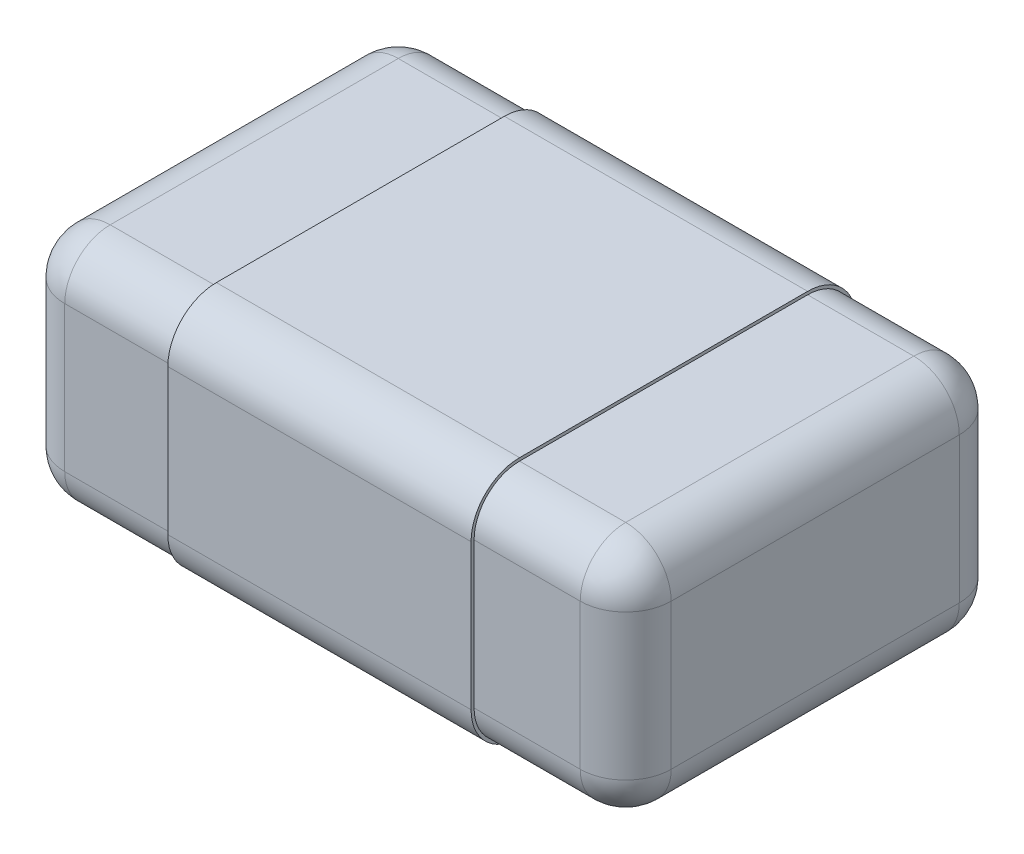
ISO-10303-21;
HEADER;
FILE_DESCRIPTION(('STEP AP214'),'2;1');
FILE_NAME('part.step','',(''),(''),'','','');
FILE_SCHEMA(('AUTOMOTIVE_DESIGN { 1 0 10303 214 1 1 1 1 }'));
ENDSEC;
DATA;
#1=APPLICATION_CONTEXT('core data for automotive mechanical design processes');
#2=APPLICATION_PROTOCOL_DEFINITION('international standard','automotive_design',2000,#1);
#3=PRODUCT_CONTEXT('',#1,'mechanical');
#4=PRODUCT('Part','Part','',(#3));
#5=PRODUCT_RELATED_PRODUCT_CATEGORY('part','',(#4));
#6=PRODUCT_DEFINITION_FORMATION('','',#4);
#7=PRODUCT_DEFINITION_CONTEXT('part definition',#1,'design');
#8=PRODUCT_DEFINITION('design','',#6,#7);
#9=PRODUCT_DEFINITION_SHAPE('','',#8);
#10=(LENGTH_UNIT() NAMED_UNIT(*) SI_UNIT(.MILLI.,.METRE.));
#11=(NAMED_UNIT(*) PLANE_ANGLE_UNIT() SI_UNIT($,.RADIAN.));
#12=(NAMED_UNIT(*) SI_UNIT($,.STERADIAN.) SOLID_ANGLE_UNIT());
#13=UNCERTAINTY_MEASURE_WITH_UNIT(LENGTH_MEASURE(1.E-05),#10,'distance_accuracy_value','');
#14=(GEOMETRIC_REPRESENTATION_CONTEXT(3) GLOBAL_UNCERTAINTY_ASSIGNED_CONTEXT((#13)) GLOBAL_UNIT_ASSIGNED_CONTEXT((#10,
#11,#12)) REPRESENTATION_CONTEXT('',''));
#15=CARTESIAN_POINT('',(0.,0.,0.));
#16=DIRECTION('',(0.,0.,1.));
#17=DIRECTION('',(1.,0.,0.));
#18=AXIS2_PLACEMENT_3D('',#15,#16,#17);
#19=CARTESIAN_POINT('',(-0.5,-0.63,-0.475));
#20=DIRECTION('',(1.,0.,0.));
#21=DIRECTION('',(0.,0.,-1.));
#22=AXIS2_PLACEMENT_3D('',#19,#20,#21);
#23=CYLINDRICAL_SURFACE('',#22,0.16);
#24=DIRECTION('',(1.,0.,0.));
#25=VECTOR('',#24,1.);
#26=CARTESIAN_POINT('',(-0.5,-0.63,-0.635));
#27=LINE('',#26,#25);
#28=CARTESIAN_POINT('',(-0.5,-0.63,-0.635));
#29=VERTEX_POINT('',#28);
#30=CARTESIAN_POINT('',(0.5,-0.63,-0.635));
#31=VERTEX_POINT('',#30);
#32=EDGE_CURVE('E323',#29,#31,#27,.T.);
#33=ORIENTED_EDGE('',*,*,#32,.T.);
#34=CARTESIAN_POINT('',(0.5,-0.63,-0.475));
#35=DIRECTION('',(1.,0.,0.));
#36=DIRECTION('',(0.,0.,-1.));
#37=AXIS2_PLACEMENT_3D('',#34,#35,#36);
#38=CIRCLE('',#37,0.16);
#39=CARTESIAN_POINT('',(0.5,-0.79,-0.475));
#40=VERTEX_POINT('',#39);
#41=EDGE_CURVE('E243',#40,#31,#38,.T.);
#42=ORIENTED_EDGE('',*,*,#41,.F.);
#43=DIRECTION('',(1.,0.,0.));
#44=VECTOR('',#43,1.);
#45=CARTESIAN_POINT('',(-0.5,-0.79,-0.475));
#46=LINE('',#45,#44);
#47=CARTESIAN_POINT('',(-0.5,-0.79,-0.475));
#48=VERTEX_POINT('',#47);
#49=EDGE_CURVE('E324',#48,#40,#46,.T.);
#50=ORIENTED_EDGE('',*,*,#49,.F.);
#51=CARTESIAN_POINT('',(-0.5,-0.63,-0.475));
#52=DIRECTION('',(1.,0.,0.));
#53=DIRECTION('',(0.,0.,-1.));
#54=AXIS2_PLACEMENT_3D('',#51,#52,#53);
#55=CIRCLE('',#54,0.16);
#56=EDGE_CURVE('E299',#48,#29,#55,.T.);
#57=ORIENTED_EDGE('',*,*,#56,.T.);
#58=EDGE_LOOP('',(#33,#42,#50,#57));
#59=FACE_BOUND('',#58,.T.);
#60=ADVANCED_FACE('F32',(#59),#23,.T.);
#61=CARTESIAN_POINT('',(-0.5,-0.79,-0.475));
#62=DIRECTION('',(0.,-1.,0.));
#63=DIRECTION('',(0.,0.,-1.));
#64=AXIS2_PLACEMENT_3D('',#61,#62,#63);
#65=PLANE('',#64);
#66=ORIENTED_EDGE('',*,*,#49,.T.);
#67=DIRECTION('',(0.,0.,-1.));
#68=VECTOR('',#67,1.);
#69=CARTESIAN_POINT('',(0.5,-0.79,-0.475));
#70=LINE('',#69,#68);
#71=CARTESIAN_POINT('',(0.5,-0.79,0.475));
#72=VERTEX_POINT('',#71);
#73=EDGE_CURVE('E280',#72,#40,#70,.T.);
#74=ORIENTED_EDGE('',*,*,#73,.F.);
#75=DIRECTION('',(1.,0.,0.));
#76=VECTOR('',#75,1.);
#77=CARTESIAN_POINT('',(-0.5,-0.79,0.475));
#78=LINE('',#77,#76);
#79=CARTESIAN_POINT('',(-0.5,-0.79,0.475));
#80=VERTEX_POINT('',#79);
#81=EDGE_CURVE('E327',#80,#72,#78,.T.);
#82=ORIENTED_EDGE('',*,*,#81,.F.);
#83=DIRECTION('',(0.,0.,-1.));
#84=VECTOR('',#83,1.);
#85=CARTESIAN_POINT('',(-0.5,-0.79,-0.475));
#86=LINE('',#85,#84);
#87=EDGE_CURVE('E320',#80,#48,#86,.T.);
#88=ORIENTED_EDGE('',*,*,#87,.T.);
#89=EDGE_LOOP('',(#66,#74,#82,#88));
#90=FACE_BOUND('',#89,.T.);
#91=ADVANCED_FACE('F553',(#90),#65,.T.);
#92=CARTESIAN_POINT('',(-0.5,-0.63,0.475));
#93=DIRECTION('',(1.,0.,0.));
#94=DIRECTION('',(0.,0.,-1.));
#95=AXIS2_PLACEMENT_3D('',#92,#93,#94);
#96=CYLINDRICAL_SURFACE('',#95,0.16);
#97=ORIENTED_EDGE('',*,*,#81,.T.);
#98=CARTESIAN_POINT('',(0.5,-0.63,0.475));
#99=DIRECTION('',(1.,0.,0.));
#100=DIRECTION('',(0.,0.,-1.));
#101=AXIS2_PLACEMENT_3D('',#98,#99,#100);
#102=CIRCLE('',#101,0.16);
#103=CARTESIAN_POINT('',(0.5,-0.63,0.635));
#104=VERTEX_POINT('',#103);
#105=EDGE_CURVE('E277',#104,#72,#102,.T.);
#106=ORIENTED_EDGE('',*,*,#105,.F.);
#107=DIRECTION('',(1.,0.,0.));
#108=VECTOR('',#107,1.);
#109=CARTESIAN_POINT('',(-0.5,-0.63,0.635));
#110=LINE('',#109,#108);
#111=CARTESIAN_POINT('',(-0.5,-0.63,0.635));
#112=VERTEX_POINT('',#111);
#113=EDGE_CURVE('E329',#112,#104,#110,.T.);
#114=ORIENTED_EDGE('',*,*,#113,.F.);
#115=CARTESIAN_POINT('',(-0.5,-0.63,0.475));
#116=DIRECTION('',(1.,0.,0.));
#117=DIRECTION('',(0.,0.,-1.));
#118=AXIS2_PLACEMENT_3D('',#115,#116,#117);
#119=CIRCLE('',#118,0.16);
#120=EDGE_CURVE('E317',#112,#80,#119,.T.);
#121=ORIENTED_EDGE('',*,*,#120,.T.);
#122=EDGE_LOOP('',(#97,#106,#114,#121));
#123=FACE_BOUND('',#122,.T.);
#124=ADVANCED_FACE('F559',(#123),#96,.T.);
#125=CARTESIAN_POINT('',(-0.5,-0.15,0.635));
#126=DIRECTION('',(0.,0.,1.));
#127=DIRECTION('',(1.,0.,0.));
#128=AXIS2_PLACEMENT_3D('',#125,#126,#127);
#129=PLANE('',#128);
#130=ORIENTED_EDGE('',*,*,#113,.T.);
#131=DIRECTION('',(0.,-1.,0.));
#132=VECTOR('',#131,1.);
#133=CARTESIAN_POINT('',(0.5,-0.15,0.635));
#134=LINE('',#133,#132);
#135=CARTESIAN_POINT('',(0.5,-0.15,0.635));
#136=VERTEX_POINT('',#135);
#137=EDGE_CURVE('E274',#136,#104,#134,.T.);
#138=ORIENTED_EDGE('',*,*,#137,.F.);
#139=DIRECTION('',(1.,0.,0.));
#140=VECTOR('',#139,1.);
#141=CARTESIAN_POINT('',(-0.5,-0.15,0.635));
#142=LINE('',#141,#140);
#143=CARTESIAN_POINT('',(-0.5,-0.15,0.635));
#144=VERTEX_POINT('',#143);
#145=EDGE_CURVE('E331',#144,#136,#142,.T.);
#146=ORIENTED_EDGE('',*,*,#145,.F.);
#147=DIRECTION('',(0.,-1.,0.));
#148=VECTOR('',#147,1.);
#149=CARTESIAN_POINT('',(-0.5,-0.15,0.635));
#150=LINE('',#149,#148);
#151=EDGE_CURVE('E314',#144,#112,#150,.T.);
#152=ORIENTED_EDGE('',*,*,#151,.T.);
#153=EDGE_LOOP('',(#130,#138,#146,#152));
#154=FACE_BOUND('',#153,.T.);
#155=ADVANCED_FACE('F663',(#154),#129,.T.);
#156=CARTESIAN_POINT('',(-0.5,-0.15,0.475));
#157=DIRECTION('',(1.,0.,0.));
#158=DIRECTION('',(0.,0.,-1.));
#159=AXIS2_PLACEMENT_3D('',#156,#157,#158);
#160=CYLINDRICAL_SURFACE('',#159,0.16);
#161=ORIENTED_EDGE('',*,*,#145,.T.);
#162=CARTESIAN_POINT('',(0.5,-0.15,0.475));
#163=DIRECTION('',(1.,0.,0.));
#164=DIRECTION('',(0.,0.,-1.));
#165=AXIS2_PLACEMENT_3D('',#162,#163,#164);
#166=CIRCLE('',#165,0.16);
#167=CARTESIAN_POINT('',(0.5,0.00999999999999981,0.475));
#168=VERTEX_POINT('',#167);
#169=EDGE_CURVE('E271',#168,#136,#166,.T.);
#170=ORIENTED_EDGE('',*,*,#169,.F.);
#171=DIRECTION('',(1.,0.,0.));
#172=VECTOR('',#171,1.);
#173=CARTESIAN_POINT('',(-0.5,0.00999999999999981,0.475));
#174=LINE('',#173,#172);
#175=CARTESIAN_POINT('',(-0.5,0.00999999999999981,0.475));
#176=VERTEX_POINT('',#175);
#177=EDGE_CURVE('E337',#176,#168,#174,.T.);
#178=ORIENTED_EDGE('',*,*,#177,.F.);
#179=CARTESIAN_POINT('',(-0.5,-0.15,0.475));
#180=DIRECTION('',(1.,0.,0.));
#181=DIRECTION('',(0.,0.,-1.));
#182=AXIS2_PLACEMENT_3D('',#179,#180,#181);
#183=CIRCLE('',#182,0.16);
#184=EDGE_CURVE('E311',#176,#144,#183,.T.);
#185=ORIENTED_EDGE('',*,*,#184,.T.);
#186=EDGE_LOOP('',(#161,#170,#178,#185));
#187=FACE_BOUND('',#186,.T.);
#188=ADVANCED_FACE('F667',(#187),#160,.T.);
#189=CARTESIAN_POINT('',(-0.5,0.00999999999999992,-0.475));
#190=DIRECTION('',(0.,1.,0.));
#191=DIRECTION('',(0.,0.,1.));
#192=AXIS2_PLACEMENT_3D('',#189,#190,#191);
#193=PLANE('',#192);
#194=ORIENTED_EDGE('',*,*,#177,.T.);
#195=DIRECTION('',(0.,0.,1.));
#196=VECTOR('',#195,1.);
#197=CARTESIAN_POINT('',(0.5,0.00999999999999992,-0.475));
#198=LINE('',#197,#196);
#199=CARTESIAN_POINT('',(0.5,0.00999999999999994,-0.475));
#200=VERTEX_POINT('',#199);
#201=EDGE_CURVE('E268',#200,#168,#198,.T.);
#202=ORIENTED_EDGE('',*,*,#201,.F.);
#203=DIRECTION('',(1.,0.,0.));
#204=VECTOR('',#203,1.);
#205=CARTESIAN_POINT('',(-0.5,0.00999999999999994,-0.475));
#206=LINE('',#205,#204);
#207=CARTESIAN_POINT('',(-0.5,0.00999999999999994,-0.475));
#208=VERTEX_POINT('',#207);
#209=EDGE_CURVE('E334',#208,#200,#206,.T.);
#210=ORIENTED_EDGE('',*,*,#209,.F.);
#211=DIRECTION('',(0.,0.,1.));
#212=VECTOR('',#211,1.);
#213=CARTESIAN_POINT('',(-0.5,0.00999999999999992,-0.475));
#214=LINE('',#213,#212);
#215=EDGE_CURVE('E308',#208,#176,#214,.T.);
#216=ORIENTED_EDGE('',*,*,#215,.T.);
#217=EDGE_LOOP('',(#194,#202,#210,#216));
#218=FACE_BOUND('',#217,.T.);
#219=ADVANCED_FACE('F671',(#218),#193,.T.);
#220=CARTESIAN_POINT('',(-0.5,-0.15,-0.475));
#221=DIRECTION('',(1.,0.,0.));
#222=DIRECTION('',(0.,0.,-1.));
#223=AXIS2_PLACEMENT_3D('',#220,#221,#222);
#224=CYLINDRICAL_SURFACE('',#223,0.16);
#225=ORIENTED_EDGE('',*,*,#209,.T.);
#226=CARTESIAN_POINT('',(0.5,-0.15,-0.475));
#227=DIRECTION('',(1.,0.,0.));
#228=DIRECTION('',(0.,0.,-1.));
#229=AXIS2_PLACEMENT_3D('',#226,#227,#228);
#230=CIRCLE('',#229,0.16);
#231=CARTESIAN_POINT('',(0.5,-0.15,-0.635));
#232=VERTEX_POINT('',#231);
#233=EDGE_CURVE('E265',#232,#200,#230,.T.);
#234=ORIENTED_EDGE('',*,*,#233,.F.);
#235=DIRECTION('',(1.,0.,0.));
#236=VECTOR('',#235,1.);
#237=CARTESIAN_POINT('',(-0.5,-0.15,-0.635));
#238=LINE('',#237,#236);
#239=CARTESIAN_POINT('',(-0.5,-0.15,-0.635));
#240=VERTEX_POINT('',#239);
#241=EDGE_CURVE('E332',#240,#232,#238,.T.);
#242=ORIENTED_EDGE('',*,*,#241,.F.);
#243=CARTESIAN_POINT('',(-0.5,-0.15,-0.475));
#244=DIRECTION('',(1.,0.,0.));
#245=DIRECTION('',(0.,0.,-1.));
#246=AXIS2_PLACEMENT_3D('',#243,#244,#245);
#247=CIRCLE('',#246,0.16);
#248=EDGE_CURVE('E305',#240,#208,#247,.T.);
#249=ORIENTED_EDGE('',*,*,#248,.T.);
#250=EDGE_LOOP('',(#225,#234,#242,#249));
#251=FACE_BOUND('',#250,.T.);
#252=ADVANCED_FACE('F674',(#251),#224,.T.);
#253=CARTESIAN_POINT('',(-0.5,-0.63,-0.635));
#254=DIRECTION('',(0.,0.,-1.));
#255=DIRECTION('',(-1.,0.,0.));
#256=AXIS2_PLACEMENT_3D('',#253,#254,#255);
#257=PLANE('',#256);
#258=ORIENTED_EDGE('',*,*,#241,.T.);
#259=DIRECTION('',(0.,1.,0.));
#260=VECTOR('',#259,1.);
#261=CARTESIAN_POINT('',(0.5,-0.63,-0.635));
#262=LINE('',#261,#260);
#263=EDGE_CURVE('E262',#31,#232,#262,.T.);
#264=ORIENTED_EDGE('',*,*,#263,.F.);
#265=ORIENTED_EDGE('',*,*,#32,.F.);
#266=DIRECTION('',(0.,1.,0.));
#267=VECTOR('',#266,1.);
#268=CARTESIAN_POINT('',(-0.5,-0.63,-0.635));
#269=LINE('',#268,#267);
#270=EDGE_CURVE('E302',#29,#240,#269,.T.);
#271=ORIENTED_EDGE('',*,*,#270,.T.);
#272=EDGE_LOOP('',(#258,#264,#265,#271));
#273=FACE_BOUND('',#272,.T.);
#274=ADVANCED_FACE('F563',(#273),#257,.T.);
#275=CARTESIAN_POINT('',(-0.5,-0.63,-0.475));
#276=DIRECTION('',(1.,0.,0.));
#277=DIRECTION('',(0.,0.,-1.));
#278=AXIS2_PLACEMENT_3D('',#275,#276,#277);
#279=PLANE('',#278);
#280=DIRECTION('',(0.,0.,-1.));
#281=VECTOR('',#280,1.);
#282=CARTESIAN_POINT('',(-0.5,-0.78,-0.475));
#283=LINE('',#282,#281);
#284=CARTESIAN_POINT('',(-0.5,-0.78,0.475));
#285=VERTEX_POINT('',#284);
#286=CARTESIAN_POINT('',(-0.5,-0.78,-0.475));
#287=VERTEX_POINT('',#286);
#288=EDGE_CURVE('E297',#285,#287,#283,.T.);
#289=ORIENTED_EDGE('',*,*,#288,.T.);
#290=CARTESIAN_POINT('',(-0.5,-0.63,-0.475));
#291=DIRECTION('',(1.,0.,0.));
#292=DIRECTION('',(0.,0.,-1.));
#293=AXIS2_PLACEMENT_3D('',#290,#291,#292);
#294=CIRCLE('',#293,0.15);
#295=CARTESIAN_POINT('',(-0.5,-0.63,-0.625));
#296=VERTEX_POINT('',#295);
#297=EDGE_CURVE('E283',#287,#296,#294,.T.);
#298=ORIENTED_EDGE('',*,*,#297,.T.);
#299=DIRECTION('',(0.,1.,0.));
#300=VECTOR('',#299,1.);
#301=CARTESIAN_POINT('',(-0.5,-0.63,-0.625));
#302=LINE('',#301,#300);
#303=CARTESIAN_POINT('',(-0.5,-0.15,-0.625));
#304=VERTEX_POINT('',#303);
#305=EDGE_CURVE('E285',#296,#304,#302,.T.);
#306=ORIENTED_EDGE('',*,*,#305,.T.);
#307=CARTESIAN_POINT('',(-0.5,-0.15,-0.475));
#308=DIRECTION('',(1.,0.,0.));
#309=DIRECTION('',(0.,0.,-1.));
#310=AXIS2_PLACEMENT_3D('',#307,#308,#309);
#311=CIRCLE('',#310,0.15);
#312=CARTESIAN_POINT('',(-0.5,0.,-0.475));
#313=VERTEX_POINT('',#312);
#314=EDGE_CURVE('E287',#304,#313,#311,.T.);
#315=ORIENTED_EDGE('',*,*,#314,.T.);
#316=DIRECTION('',(0.,0.,1.));
#317=VECTOR('',#316,1.);
#318=CARTESIAN_POINT('',(-0.5,0.,-0.475));
#319=LINE('',#318,#317);
#320=CARTESIAN_POINT('',(-0.5,0.,0.475));
#321=VERTEX_POINT('',#320);
#322=EDGE_CURVE('E289',#313,#321,#319,.T.);
#323=ORIENTED_EDGE('',*,*,#322,.T.);
#324=CARTESIAN_POINT('',(-0.5,-0.15,0.475));
#325=DIRECTION('',(1.,0.,0.));
#326=DIRECTION('',(0.,0.,-1.));
#327=AXIS2_PLACEMENT_3D('',#324,#325,#326);
#328=CIRCLE('',#327,0.15);
#329=CARTESIAN_POINT('',(-0.5,-0.15,0.625));
#330=VERTEX_POINT('',#329);
#331=EDGE_CURVE('E291',#321,#330,#328,.T.);
#332=ORIENTED_EDGE('',*,*,#331,.T.);
#333=DIRECTION('',(0.,-1.,0.));
#334=VECTOR('',#333,1.);
#335=CARTESIAN_POINT('',(-0.5,-0.15,0.625));
#336=LINE('',#335,#334);
#337=CARTESIAN_POINT('',(-0.5,-0.63,0.625));
#338=VERTEX_POINT('',#337);
#339=EDGE_CURVE('E293',#330,#338,#336,.T.);
#340=ORIENTED_EDGE('',*,*,#339,.T.);
#341=CARTESIAN_POINT('',(-0.5,-0.63,0.475));
#342=DIRECTION('',(1.,0.,0.));
#343=DIRECTION('',(0.,0.,-1.));
#344=AXIS2_PLACEMENT_3D('',#341,#342,#343);
#345=CIRCLE('',#344,0.15);
#346=EDGE_CURVE('E295',#338,#285,#345,.T.);
#347=ORIENTED_EDGE('',*,*,#346,.T.);
#348=EDGE_LOOP('',(#289,#298,#306,#315,#323,#332,#340,#347));
#349=FACE_BOUND('',#348,.T.);
#350=ORIENTED_EDGE('',*,*,#56,.F.);
#351=ORIENTED_EDGE('',*,*,#87,.F.);
#352=ORIENTED_EDGE('',*,*,#120,.F.);
#353=ORIENTED_EDGE('',*,*,#151,.F.);
#354=ORIENTED_EDGE('',*,*,#184,.F.);
#355=ORIENTED_EDGE('',*,*,#215,.F.);
#356=ORIENTED_EDGE('',*,*,#248,.F.);
#357=ORIENTED_EDGE('',*,*,#270,.F.);
#358=EDGE_LOOP('',(#350,#351,#352,#353,#354,#355,#356,#357));
#359=FACE_BOUND('',#358,.T.);
#360=ADVANCED_FACE('F503',(#349,#359),#279,.F.);
#361=CARTESIAN_POINT('',(-1.,-0.78,-0.625));
#362=DIRECTION('',(-1.,0.,0.));
#363=DIRECTION('',(0.,0.,1.));
#364=AXIS2_PLACEMENT_3D('',#361,#362,#363);
#365=PLANE('',#364);
#366=DIRECTION('',(0.,0.,1.));
#367=VECTOR('',#366,1.);
#368=CARTESIAN_POINT('',(-1.,-0.15,-0.625));
#369=LINE('',#368,#367);
#370=CARTESIAN_POINT('',(-1.,-0.15,0.475));
#371=VERTEX_POINT('',#370);
#372=CARTESIAN_POINT('',(-1.,-0.15,-0.475));
#373=VERTEX_POINT('',#372);
#374=EDGE_CURVE('E365',#371,#373,#369,.F.);
#375=ORIENTED_EDGE('',*,*,#374,.T.);
#376=DIRECTION('',(0.,1.,0.));
#377=VECTOR('',#376,1.);
#378=CARTESIAN_POINT('',(-1.,-0.78,-0.475));
#379=LINE('',#378,#377);
#380=CARTESIAN_POINT('',(-1.,-0.63,-0.475));
#381=VERTEX_POINT('',#380);
#382=EDGE_CURVE('E369',#373,#381,#379,.F.);
#383=ORIENTED_EDGE('',*,*,#382,.T.);
#384=DIRECTION('',(0.,0.,1.));
#385=VECTOR('',#384,1.);
#386=CARTESIAN_POINT('',(-1.,-0.63,0.625));
#387=LINE('',#386,#385);
#388=CARTESIAN_POINT('',(-1.,-0.63,0.475));
#389=VERTEX_POINT('',#388);
#390=EDGE_CURVE('E367',#381,#389,#387,.T.);
#391=ORIENTED_EDGE('',*,*,#390,.T.);
#392=DIRECTION('',(0.,1.,0.));
#393=VECTOR('',#392,1.);
#394=CARTESIAN_POINT('',(-1.,-0.78,0.475));
#395=LINE('',#394,#393);
#396=EDGE_CURVE('E363',#389,#371,#395,.T.);
#397=ORIENTED_EDGE('',*,*,#396,.T.);
#398=EDGE_LOOP('',(#375,#383,#391,#397));
#399=FACE_BOUND('',#398,.T.);
#400=ADVANCED_FACE('F659',(#399),#365,.T.);
#401=CARTESIAN_POINT('',(-0.85,-0.78,-0.475));
#402=DIRECTION('',(0.,1.,0.));
#403=DIRECTION('',(0.,0.,1.));
#404=AXIS2_PLACEMENT_3D('',#401,#402,#403);
#405=CYLINDRICAL_SURFACE('',#404,0.15);
#406=CARTESIAN_POINT('',(-0.85,-0.15,-0.475));
#407=DIRECTION('',(0.,1.,0.));
#408=DIRECTION('',(0.,0.,1.));
#409=AXIS2_PLACEMENT_3D('',#406,#407,#408);
#410=CIRCLE('',#409,0.15);
#411=CARTESIAN_POINT('',(-0.85,-0.15,-0.625));
#412=VERTEX_POINT('',#411);
#413=EDGE_CURVE('E447',#373,#412,#410,.F.);
#414=ORIENTED_EDGE('',*,*,#413,.T.);
#415=DIRECTION('',(0.,1.,0.));
#416=VECTOR('',#415,1.);
#417=CARTESIAN_POINT('',(-0.85,-0.78,-0.625));
#418=LINE('',#417,#416);
#419=CARTESIAN_POINT('',(-0.85,-0.63,-0.625));
#420=VERTEX_POINT('',#419);
#421=EDGE_CURVE('E352',#420,#412,#418,.T.);
#422=ORIENTED_EDGE('',*,*,#421,.F.);
#423=CARTESIAN_POINT('',(-0.85,-0.63,-0.475));
#424=DIRECTION('',(0.,-1.,0.));
#425=DIRECTION('',(0.,0.,-1.));
#426=AXIS2_PLACEMENT_3D('',#423,#424,#425);
#427=CIRCLE('',#426,0.15);
#428=EDGE_CURVE('E458',#381,#420,#427,.T.);
#429=ORIENTED_EDGE('',*,*,#428,.F.);
#430=ORIENTED_EDGE('',*,*,#382,.F.);
#431=EDGE_LOOP('',(#414,#422,#429,#430));
#432=FACE_BOUND('',#431,.T.);
#433=ADVANCED_FACE('F521',(#432),#405,.T.);
#434=CARTESIAN_POINT('',(-0.85,-0.78,0.475));
#435=DIRECTION('',(0.,1.,0.));
#436=DIRECTION('',(0.,0.,1.));
#437=AXIS2_PLACEMENT_3D('',#434,#435,#436);
#438=CYLINDRICAL_SURFACE('',#437,0.15);
#439=CARTESIAN_POINT('',(-0.85,-0.15,0.475));
#440=DIRECTION('',(0.,1.,0.));
#441=DIRECTION('',(0.,0.,1.));
#442=AXIS2_PLACEMENT_3D('',#439,#440,#441);
#443=CIRCLE('',#442,0.15);
#444=CARTESIAN_POINT('',(-0.85,-0.15,0.625));
#445=VERTEX_POINT('',#444);
#446=EDGE_CURVE('E415',#445,#371,#443,.F.);
#447=ORIENTED_EDGE('',*,*,#446,.T.);
#448=ORIENTED_EDGE('',*,*,#396,.F.);
#449=CARTESIAN_POINT('',(-0.85,-0.63,0.475));
#450=DIRECTION('',(0.,-1.,0.));
#451=DIRECTION('',(0.,0.,-1.));
#452=AXIS2_PLACEMENT_3D('',#449,#450,#451);
#453=CIRCLE('',#452,0.15);
#454=CARTESIAN_POINT('',(-0.85,-0.63,0.625));
#455=VERTEX_POINT('',#454);
#456=EDGE_CURVE('E436',#455,#389,#453,.T.);
#457=ORIENTED_EDGE('',*,*,#456,.F.);
#458=DIRECTION('',(0.,1.,0.));
#459=VECTOR('',#458,1.);
#460=CARTESIAN_POINT('',(-0.85,-0.78,0.625));
#461=LINE('',#460,#459);
#462=EDGE_CURVE('E466',#445,#455,#461,.F.);
#463=ORIENTED_EDGE('',*,*,#462,.F.);
#464=EDGE_LOOP('',(#447,#448,#457,#463));
#465=FACE_BOUND('',#464,.T.);
#466=ADVANCED_FACE('F491',(#465),#438,.T.);
#467=CARTESIAN_POINT('',(-0.85,-0.63,-0.625));
#468=DIRECTION('',(0.,0.,-1.));
#469=DIRECTION('',(-1.,0.,0.));
#470=AXIS2_PLACEMENT_3D('',#467,#468,#469);
#471=CYLINDRICAL_SURFACE('',#470,0.15);
#472=CARTESIAN_POINT('',(-0.85,-0.63,0.475));
#473=DIRECTION('',(0.,0.,1.));
#474=DIRECTION('',(0.,-1.,0.));
#475=AXIS2_PLACEMENT_3D('',#472,#473,#474);
#476=CIRCLE('',#475,0.15);
#477=CARTESIAN_POINT('',(-0.85,-0.78,0.475));
#478=VERTEX_POINT('',#477);
#479=EDGE_CURVE('E450',#478,#389,#476,.F.);
#480=ORIENTED_EDGE('',*,*,#479,.T.);
#481=ORIENTED_EDGE('',*,*,#390,.F.);
#482=CARTESIAN_POINT('',(-0.85,-0.63,-0.475));
#483=DIRECTION('',(0.,0.,-1.));
#484=DIRECTION('',(-1.,0.,0.));
#485=AXIS2_PLACEMENT_3D('',#482,#483,#484);
#486=CIRCLE('',#485,0.15);
#487=CARTESIAN_POINT('',(-0.85,-0.78,-0.475));
#488=VERTEX_POINT('',#487);
#489=EDGE_CURVE('E461',#488,#381,#486,.T.);
#490=ORIENTED_EDGE('',*,*,#489,.F.);
#491=DIRECTION('',(0.,0.,1.));
#492=VECTOR('',#491,1.);
#493=CARTESIAN_POINT('',(-0.85,-0.78,-0.625));
#494=LINE('',#493,#492);
#495=EDGE_CURVE('E233',#478,#488,#494,.F.);
#496=ORIENTED_EDGE('',*,*,#495,.F.);
#497=EDGE_LOOP('',(#480,#481,#490,#496));
#498=FACE_BOUND('',#497,.T.);
#499=ADVANCED_FACE('F589',(#498),#471,.T.);
#500=CARTESIAN_POINT('',(-0.85,-0.15,0.));
#501=DIRECTION('',(0.,0.,1.));
#502=DIRECTION('',(1.,0.,0.));
#503=AXIS2_PLACEMENT_3D('',#500,#501,#502);
#504=CYLINDRICAL_SURFACE('',#503,0.15);
#505=CARTESIAN_POINT('',(-0.85,-0.15,0.475));
#506=DIRECTION('',(0.,0.,1.));
#507=DIRECTION('',(1.,0.,0.));
#508=AXIS2_PLACEMENT_3D('',#505,#506,#507);
#509=CIRCLE('',#508,0.15);
#510=CARTESIAN_POINT('',(-0.85,0.,0.475));
#511=VERTEX_POINT('',#510);
#512=EDGE_CURVE('E412',#371,#511,#509,.F.);
#513=ORIENTED_EDGE('',*,*,#512,.T.);
#514=DIRECTION('',(0.,0.,1.));
#515=VECTOR('',#514,1.);
#516=CARTESIAN_POINT('',(-0.85,0.,0.));
#517=LINE('',#516,#515);
#518=CARTESIAN_POINT('',(-0.85,0.,-0.475));
#519=VERTEX_POINT('',#518);
#520=EDGE_CURVE('E386',#519,#511,#517,.T.);
#521=ORIENTED_EDGE('',*,*,#520,.F.);
#522=CARTESIAN_POINT('',(-0.85,-0.15,-0.475));
#523=DIRECTION('',(0.,0.,-1.));
#524=DIRECTION('',(-1.,0.,0.));
#525=AXIS2_PLACEMENT_3D('',#522,#523,#524);
#526=CIRCLE('',#525,0.15);
#527=EDGE_CURVE('E433',#373,#519,#526,.T.);
#528=ORIENTED_EDGE('',*,*,#527,.F.);
#529=ORIENTED_EDGE('',*,*,#374,.F.);
#530=EDGE_LOOP('',(#513,#521,#528,#529));
#531=FACE_BOUND('',#530,.T.);
#532=ADVANCED_FACE('F537',(#531),#504,.T.);
#533=CARTESIAN_POINT('',(-0.85,-0.15,0.475));
#534=DIRECTION('',(0.,0.,1.));
#535=DIRECTION('',(1.,0.,0.));
#536=AXIS2_PLACEMENT_3D('',#533,#534,#535);
#537=SPHERICAL_SURFACE('',#536,0.15);
#538=ORIENTED_EDGE('',*,*,#446,.F.);
#539=CARTESIAN_POINT('',(-0.85,-0.15,0.475));
#540=DIRECTION('',(-1.,0.,0.));
#541=DIRECTION('',(0.,0.,1.));
#542=AXIS2_PLACEMENT_3D('',#539,#540,#541);
#543=CIRCLE('',#542,0.15);
#544=EDGE_CURVE('E403',#445,#511,#543,.T.);
#545=ORIENTED_EDGE('',*,*,#544,.T.);
#546=ORIENTED_EDGE('',*,*,#512,.F.);
#547=EDGE_LOOP('',(#538,#545,#546));
#548=FACE_BOUND('',#547,.T.);
#549=ADVANCED_FACE('F486',(#548),#537,.T.);
#550=CARTESIAN_POINT('',(-0.85,-0.15,-0.475));
#551=DIRECTION('',(0.,0.,1.));
#552=DIRECTION('',(1.,0.,0.));
#553=AXIS2_PLACEMENT_3D('',#550,#551,#552);
#554=SPHERICAL_SURFACE('',#553,0.15);
#555=ORIENTED_EDGE('',*,*,#527,.T.);
#556=CARTESIAN_POINT('',(-0.85,-0.15,-0.475));
#557=DIRECTION('',(-1.,0.,0.));
#558=DIRECTION('',(0.,0.,1.));
#559=AXIS2_PLACEMENT_3D('',#556,#557,#558);
#560=CIRCLE('',#559,0.15);
#561=EDGE_CURVE('E430',#519,#412,#560,.T.);
#562=ORIENTED_EDGE('',*,*,#561,.T.);
#563=ORIENTED_EDGE('',*,*,#413,.F.);
#564=EDGE_LOOP('',(#555,#562,#563));
#565=FACE_BOUND('',#564,.T.);
#566=ADVANCED_FACE('F534',(#565),#554,.T.);
#567=CARTESIAN_POINT('',(-0.85,-0.63,0.475));
#568=DIRECTION('',(0.,0.,1.));
#569=DIRECTION('',(1.,0.,0.));
#570=AXIS2_PLACEMENT_3D('',#567,#568,#569);
#571=SPHERICAL_SURFACE('',#570,0.15);
#572=CARTESIAN_POINT('',(-0.85,-0.63,0.475));
#573=DIRECTION('',(-1.,0.,0.));
#574=DIRECTION('',(0.,0.,1.));
#575=AXIS2_PLACEMENT_3D('',#572,#573,#574);
#576=CIRCLE('',#575,0.15);
#577=EDGE_CURVE('E439',#478,#455,#576,.T.);
#578=ORIENTED_EDGE('',*,*,#577,.T.);
#579=ORIENTED_EDGE('',*,*,#456,.T.);
#580=ORIENTED_EDGE('',*,*,#479,.F.);
#581=EDGE_LOOP('',(#578,#579,#580));
#582=FACE_BOUND('',#581,.T.);
#583=ADVANCED_FACE('F495',(#582),#571,.T.);
#584=CARTESIAN_POINT('',(-0.85,-0.63,-0.475));
#585=DIRECTION('',(0.,0.,1.));
#586=DIRECTION('',(1.,0.,0.));
#587=AXIS2_PLACEMENT_3D('',#584,#585,#586);
#588=SPHERICAL_SURFACE('',#587,0.15);
#589=ORIENTED_EDGE('',*,*,#489,.T.);
#590=ORIENTED_EDGE('',*,*,#428,.T.);
#591=CARTESIAN_POINT('',(-0.85,-0.63,-0.475));
#592=DIRECTION('',(-1.,0.,0.));
#593=DIRECTION('',(0.,0.,1.));
#594=AXIS2_PLACEMENT_3D('',#591,#592,#593);
#595=CIRCLE('',#594,0.15);
#596=EDGE_CURVE('E326',#488,#420,#595,.F.);
#597=ORIENTED_EDGE('',*,*,#596,.F.);
#598=EDGE_LOOP('',(#589,#590,#597));
#599=FACE_BOUND('',#598,.T.);
#600=ADVANCED_FACE('F515',(#599),#588,.T.);
#601=CARTESIAN_POINT('',(0.,-0.15,-0.475));
#602=DIRECTION('',(-1.,0.,0.));
#603=DIRECTION('',(0.,0.,1.));
#604=AXIS2_PLACEMENT_3D('',#601,#602,#603);
#605=CYLINDRICAL_SURFACE('',#604,0.15);
#606=DIRECTION('',(-1.,0.,0.));
#607=VECTOR('',#606,1.);
#608=CARTESIAN_POINT('',(0.,0.,-0.475));
#609=LINE('',#608,#607);
#610=EDGE_CURVE('E388',#313,#519,#609,.T.);
#611=ORIENTED_EDGE('',*,*,#610,.F.);
#612=ORIENTED_EDGE('',*,*,#314,.F.);
#613=DIRECTION('',(-1.,0.,0.));
#614=VECTOR('',#613,1.);
#615=CARTESIAN_POINT('',(1.,-0.15,-0.625));
#616=LINE('',#615,#614);
#617=EDGE_CURVE('E346',#412,#304,#616,.F.);
#618=ORIENTED_EDGE('',*,*,#617,.F.);
#619=ORIENTED_EDGE('',*,*,#561,.F.);
#620=EDGE_LOOP('',(#611,#612,#618,#619));
#621=FACE_BOUND('',#620,.T.);
#622=ADVANCED_FACE('F531',(#621),#605,.T.);
#623=CARTESIAN_POINT('',(0.,-0.15,0.475));
#624=DIRECTION('',(1.,0.,0.));
#625=DIRECTION('',(0.,0.,-1.));
#626=AXIS2_PLACEMENT_3D('',#623,#624,#625);
#627=CYLINDRICAL_SURFACE('',#626,0.15);
#628=DIRECTION('',(1.,0.,0.));
#629=VECTOR('',#628,1.);
#630=CARTESIAN_POINT('',(-1.,-0.15,0.625));
#631=LINE('',#630,#629);
#632=EDGE_CURVE('E399',#330,#445,#631,.F.);
#633=ORIENTED_EDGE('',*,*,#632,.F.);
#634=ORIENTED_EDGE('',*,*,#331,.F.);
#635=DIRECTION('',(1.,0.,0.));
#636=VECTOR('',#635,1.);
#637=CARTESIAN_POINT('',(0.,0.,0.475));
#638=LINE('',#637,#636);
#639=EDGE_CURVE('E380',#511,#321,#638,.T.);
#640=ORIENTED_EDGE('',*,*,#639,.F.);
#641=ORIENTED_EDGE('',*,*,#544,.F.);
#642=EDGE_LOOP('',(#633,#634,#640,#641));
#643=FACE_BOUND('',#642,.T.);
#644=ADVANCED_FACE('F483',(#643),#627,.T.);
#645=CARTESIAN_POINT('',(0.,0.,0.));
#646=DIRECTION('',(0.,1.,0.));
#647=DIRECTION('',(0.,0.,1.));
#648=AXIS2_PLACEMENT_3D('',#645,#646,#647);
#649=PLANE('',#648);
#650=ORIENTED_EDGE('',*,*,#639,.T.);
#651=ORIENTED_EDGE('',*,*,#322,.F.);
#652=ORIENTED_EDGE('',*,*,#610,.T.);
#653=ORIENTED_EDGE('',*,*,#520,.T.);
#654=EDGE_LOOP('',(#650,#651,#652,#653));
#655=FACE_BOUND('',#654,.T.);
#656=ADVANCED_FACE('F539',(#655),#649,.T.);
#657=CARTESIAN_POINT('',(1.,-0.63,-0.475));
#658=DIRECTION('',(1.,0.,0.));
#659=DIRECTION('',(0.,0.,-1.));
#660=AXIS2_PLACEMENT_3D('',#657,#658,#659);
#661=CYLINDRICAL_SURFACE('',#660,0.15);
#662=DIRECTION('',(-1.,0.,0.));
#663=VECTOR('',#662,1.);
#664=CARTESIAN_POINT('',(-1.,-0.63,-0.625));
#665=LINE('',#664,#663);
#666=EDGE_CURVE('E354',#296,#420,#665,.T.);
#667=ORIENTED_EDGE('',*,*,#666,.F.);
#668=ORIENTED_EDGE('',*,*,#297,.F.);
#669=DIRECTION('',(-1.,0.,0.));
#670=VECTOR('',#669,1.);
#671=CARTESIAN_POINT('',(1.,-0.78,-0.475));
#672=LINE('',#671,#670);
#673=EDGE_CURVE('E232',#488,#287,#672,.F.);
#674=ORIENTED_EDGE('',*,*,#673,.F.);
#675=ORIENTED_EDGE('',*,*,#596,.T.);
#676=EDGE_LOOP('',(#667,#668,#674,#675));
#677=FACE_BOUND('',#676,.T.);
#678=ADVANCED_FACE('F513',(#677),#661,.T.);
#679=CARTESIAN_POINT('',(-1.,-0.63,0.475));
#680=DIRECTION('',(-1.,0.,0.));
#681=DIRECTION('',(0.,0.,1.));
#682=AXIS2_PLACEMENT_3D('',#679,#680,#681);
#683=CYLINDRICAL_SURFACE('',#682,0.15);
#684=DIRECTION('',(1.,0.,0.));
#685=VECTOR('',#684,1.);
#686=CARTESIAN_POINT('',(-1.,-0.78,0.475));
#687=LINE('',#686,#685);
#688=EDGE_CURVE('E357',#285,#478,#687,.F.);
#689=ORIENTED_EDGE('',*,*,#688,.F.);
#690=ORIENTED_EDGE('',*,*,#346,.F.);
#691=DIRECTION('',(1.,0.,0.));
#692=VECTOR('',#691,1.);
#693=CARTESIAN_POINT('',(1.,-0.63,0.625));
#694=LINE('',#693,#692);
#695=EDGE_CURVE('E11',#455,#338,#694,.T.);
#696=ORIENTED_EDGE('',*,*,#695,.F.);
#697=ORIENTED_EDGE('',*,*,#577,.F.);
#698=EDGE_LOOP('',(#689,#690,#696,#697));
#699=FACE_BOUND('',#698,.T.);
#700=ADVANCED_FACE('F499',(#699),#683,.T.);
#701=CARTESIAN_POINT('',(0.,-0.78,0.));
#702=DIRECTION('',(0.,1.,0.));
#703=DIRECTION('',(0.,0.,1.));
#704=AXIS2_PLACEMENT_3D('',#701,#702,#703);
#705=PLANE('',#704);
#706=ORIENTED_EDGE('',*,*,#288,.F.);
#707=ORIENTED_EDGE('',*,*,#688,.T.);
#708=ORIENTED_EDGE('',*,*,#495,.T.);
#709=ORIENTED_EDGE('',*,*,#673,.T.);
#710=EDGE_LOOP('',(#706,#707,#708,#709));
#711=FACE_BOUND('',#710,.T.);
#712=ADVANCED_FACE('F507',(#711),#705,.F.);
#713=CARTESIAN_POINT('',(-1.,-0.78,0.625));
#714=DIRECTION('',(0.,0.,1.));
#715=DIRECTION('',(1.,0.,0.));
#716=AXIS2_PLACEMENT_3D('',#713,#714,#715);
#717=PLANE('',#716);
#718=ORIENTED_EDGE('',*,*,#695,.T.);
#719=ORIENTED_EDGE('',*,*,#339,.F.);
#720=ORIENTED_EDGE('',*,*,#632,.T.);
#721=ORIENTED_EDGE('',*,*,#462,.T.);
#722=EDGE_LOOP('',(#718,#719,#720,#721));
#723=FACE_BOUND('',#722,.T.);
#724=ADVANCED_FACE('F476',(#723),#717,.T.);
#725=CARTESIAN_POINT('',(1.,-0.78,-0.625));
#726=DIRECTION('',(0.,0.,-1.));
#727=DIRECTION('',(-1.,0.,0.));
#728=AXIS2_PLACEMENT_3D('',#725,#726,#727);
#729=PLANE('',#728);
#730=ORIENTED_EDGE('',*,*,#617,.T.);
#731=ORIENTED_EDGE('',*,*,#305,.F.);
#732=ORIENTED_EDGE('',*,*,#666,.T.);
#733=ORIENTED_EDGE('',*,*,#421,.T.);
#734=EDGE_LOOP('',(#730,#731,#732,#733));
#735=FACE_BOUND('',#734,.T.);
#736=ADVANCED_FACE('F525',(#735),#729,.T.);
#737=CARTESIAN_POINT('',(0.5,-0.63,-0.475));
#738=DIRECTION('',(1.,0.,0.));
#739=DIRECTION('',(0.,0.,-1.));
#740=AXIS2_PLACEMENT_3D('',#737,#738,#739);
#741=PLANE('',#740);
#742=ORIENTED_EDGE('',*,*,#41,.T.);
#743=ORIENTED_EDGE('',*,*,#263,.T.);
#744=ORIENTED_EDGE('',*,*,#233,.T.);
#745=ORIENTED_EDGE('',*,*,#201,.T.);
#746=ORIENTED_EDGE('',*,*,#169,.T.);
#747=ORIENTED_EDGE('',*,*,#137,.T.);
#748=ORIENTED_EDGE('',*,*,#105,.T.);
#749=ORIENTED_EDGE('',*,*,#73,.T.);
#750=EDGE_LOOP('',(#742,#743,#744,#745,#746,#747,#748,#749));
#751=FACE_BOUND('',#750,.T.);
#752=DIRECTION('',(0.,1.,0.));
#753=VECTOR('',#752,1.);
#754=CARTESIAN_POINT('',(0.5,-0.63,-0.625));
#755=LINE('',#754,#753);
#756=CARTESIAN_POINT('',(0.5,-0.63,-0.625));
#757=VERTEX_POINT('',#756);
#758=CARTESIAN_POINT('',(0.5,-0.15,-0.625));
#759=VERTEX_POINT('',#758);
#760=EDGE_CURVE('E249',#757,#759,#755,.T.);
#761=ORIENTED_EDGE('',*,*,#760,.F.);
#762=CARTESIAN_POINT('',(0.5,-0.63,-0.475));
#763=DIRECTION('',(1.,0.,0.));
#764=DIRECTION('',(0.,0.,-1.));
#765=AXIS2_PLACEMENT_3D('',#762,#763,#764);
#766=CIRCLE('',#765,0.15);
#767=CARTESIAN_POINT('',(0.5,-0.78,-0.475));
#768=VERTEX_POINT('',#767);
#769=EDGE_CURVE('E226',#768,#757,#766,.T.);
#770=ORIENTED_EDGE('',*,*,#769,.F.);
#771=DIRECTION('',(0.,0.,-1.));
#772=VECTOR('',#771,1.);
#773=CARTESIAN_POINT('',(0.5,-0.78,-0.475));
#774=LINE('',#773,#772);
#775=CARTESIAN_POINT('',(0.5,-0.78,0.475));
#776=VERTEX_POINT('',#775);
#777=EDGE_CURVE('E237',#776,#768,#774,.T.);
#778=ORIENTED_EDGE('',*,*,#777,.F.);
#779=CARTESIAN_POINT('',(0.5,-0.63,0.475));
#780=DIRECTION('',(1.,0.,0.));
#781=DIRECTION('',(0.,0.,-1.));
#782=AXIS2_PLACEMENT_3D('',#779,#780,#781);
#783=CIRCLE('',#782,0.15);
#784=CARTESIAN_POINT('',(0.5,-0.63,0.625));
#785=VERTEX_POINT('',#784);
#786=EDGE_CURVE('E244',#785,#776,#783,.T.);
#787=ORIENTED_EDGE('',*,*,#786,.F.);
#788=DIRECTION('',(0.,-1.,0.));
#789=VECTOR('',#788,1.);
#790=CARTESIAN_POINT('',(0.5,-0.15,0.625));
#791=LINE('',#790,#789);
#792=CARTESIAN_POINT('',(0.5,-0.15,0.625));
#793=VERTEX_POINT('',#792);
#794=EDGE_CURVE('E257',#793,#785,#791,.T.);
#795=ORIENTED_EDGE('',*,*,#794,.F.);
#796=CARTESIAN_POINT('',(0.5,-0.15,0.475));
#797=DIRECTION('',(1.,0.,0.));
#798=DIRECTION('',(0.,0.,-1.));
#799=AXIS2_PLACEMENT_3D('',#796,#797,#798);
#800=CIRCLE('',#799,0.15);
#801=CARTESIAN_POINT('',(0.5,0.,0.475));
#802=VERTEX_POINT('',#801);
#803=EDGE_CURVE('E50',#802,#793,#800,.T.);
#804=ORIENTED_EDGE('',*,*,#803,.F.);
#805=DIRECTION('',(0.,0.,1.));
#806=VECTOR('',#805,1.);
#807=CARTESIAN_POINT('',(0.5,0.,-0.475));
#808=LINE('',#807,#806);
#809=CARTESIAN_POINT('',(0.5,0.,-0.475));
#810=VERTEX_POINT('',#809);
#811=EDGE_CURVE('E58',#810,#802,#808,.T.);
#812=ORIENTED_EDGE('',*,*,#811,.F.);
#813=CARTESIAN_POINT('',(0.5,-0.15,-0.475));
#814=DIRECTION('',(1.,0.,0.));
#815=DIRECTION('',(0.,0.,-1.));
#816=AXIS2_PLACEMENT_3D('',#813,#814,#815);
#817=CIRCLE('',#816,0.15);
#818=EDGE_CURVE('E251',#759,#810,#817,.T.);
#819=ORIENTED_EDGE('',*,*,#818,.F.);
#820=EDGE_LOOP('',(#761,#770,#778,#787,#795,#804,#812,#819));
#821=FACE_BOUND('',#820,.T.);
#822=ADVANCED_FACE('F247',(#751,#821),#741,.T.);
#823=CARTESIAN_POINT('',(1.,-0.78,0.625));
#824=DIRECTION('',(1.,0.,0.));
#825=DIRECTION('',(0.,0.,-1.));
#826=AXIS2_PLACEMENT_3D('',#823,#824,#825);
#827=PLANE('',#826);
#828=DIRECTION('',(0.,0.,-1.));
#829=VECTOR('',#828,1.);
#830=CARTESIAN_POINT('',(1.,-0.63,-0.625));
#831=LINE('',#830,#829);
#832=CARTESIAN_POINT('',(1.,-0.63,0.475));
#833=VERTEX_POINT('',#832);
#834=CARTESIAN_POINT('',(1.,-0.63,-0.475));
#835=VERTEX_POINT('',#834);
#836=EDGE_CURVE('E376',#833,#835,#831,.T.);
#837=ORIENTED_EDGE('',*,*,#836,.T.);
#838=DIRECTION('',(0.,1.,0.));
#839=VECTOR('',#838,1.);
#840=CARTESIAN_POINT('',(1.,-0.78,-0.475));
#841=LINE('',#840,#839);
#842=CARTESIAN_POINT('',(1.,-0.15,-0.475));
#843=VERTEX_POINT('',#842);
#844=EDGE_CURVE('E378',#835,#843,#841,.T.);
#845=ORIENTED_EDGE('',*,*,#844,.T.);
#846=DIRECTION('',(0.,0.,-1.));
#847=VECTOR('',#846,1.);
#848=CARTESIAN_POINT('',(1.,-0.15,0.625));
#849=LINE('',#848,#847);
#850=CARTESIAN_POINT('',(1.,-0.15,0.475));
#851=VERTEX_POINT('',#850);
#852=EDGE_CURVE('E374',#843,#851,#849,.F.);
#853=ORIENTED_EDGE('',*,*,#852,.T.);
#854=DIRECTION('',(0.,1.,0.));
#855=VECTOR('',#854,1.);
#856=CARTESIAN_POINT('',(1.,-0.78,0.475));
#857=LINE('',#856,#855);
#858=EDGE_CURVE('E372',#851,#833,#857,.F.);
#859=ORIENTED_EDGE('',*,*,#858,.T.);
#860=EDGE_LOOP('',(#837,#845,#853,#859));
#861=FACE_BOUND('',#860,.T.);
#862=ADVANCED_FACE('F633',(#861),#827,.T.);
#863=CARTESIAN_POINT('',(0.85,-0.78,-0.475));
#864=DIRECTION('',(0.,1.,0.));
#865=DIRECTION('',(0.,0.,1.));
#866=AXIS2_PLACEMENT_3D('',#863,#864,#865);
#867=CYLINDRICAL_SURFACE('',#866,0.15);
#868=CARTESIAN_POINT('',(0.85,-0.15,-0.475));
#869=DIRECTION('',(0.,1.,0.));
#870=DIRECTION('',(0.,0.,1.));
#871=AXIS2_PLACEMENT_3D('',#868,#869,#870);
#872=CIRCLE('',#871,0.15);
#873=CARTESIAN_POINT('',(0.85,-0.15,-0.625));
#874=VERTEX_POINT('',#873);
#875=EDGE_CURVE('E445',#874,#843,#872,.F.);
#876=ORIENTED_EDGE('',*,*,#875,.T.);
#877=ORIENTED_EDGE('',*,*,#844,.F.);
#878=CARTESIAN_POINT('',(0.85,-0.63,-0.475));
#879=DIRECTION('',(0.,-1.,0.));
#880=DIRECTION('',(0.,0.,-1.));
#881=AXIS2_PLACEMENT_3D('',#878,#879,#880);
#882=CIRCLE('',#881,0.15);
#883=CARTESIAN_POINT('',(0.85,-0.63,-0.625));
#884=VERTEX_POINT('',#883);
#885=EDGE_CURVE('E455',#884,#835,#882,.T.);
#886=ORIENTED_EDGE('',*,*,#885,.F.);
#887=DIRECTION('',(0.,1.,0.));
#888=VECTOR('',#887,1.);
#889=CARTESIAN_POINT('',(0.85,-0.78,-0.625));
#890=LINE('',#889,#888);
#891=EDGE_CURVE('E349',#874,#884,#890,.F.);
#892=ORIENTED_EDGE('',*,*,#891,.F.);
#893=EDGE_LOOP('',(#876,#877,#886,#892));
#894=FACE_BOUND('',#893,.T.);
#895=ADVANCED_FACE('F606',(#894),#867,.T.);
#896=CARTESIAN_POINT('',(0.85,-0.78,0.475));
#897=DIRECTION('',(0.,1.,0.));
#898=DIRECTION('',(0.,0.,1.));
#899=AXIS2_PLACEMENT_3D('',#896,#897,#898);
#900=CYLINDRICAL_SURFACE('',#899,0.15);
#901=CARTESIAN_POINT('',(0.85,-0.15,0.475));
#902=DIRECTION('',(0.,1.,0.));
#903=DIRECTION('',(0.,0.,1.));
#904=AXIS2_PLACEMENT_3D('',#901,#902,#903);
#905=CIRCLE('',#904,0.15);
#906=CARTESIAN_POINT('',(0.85,-0.15,0.625));
#907=VERTEX_POINT('',#906);
#908=EDGE_CURVE('E406',#851,#907,#905,.F.);
#909=ORIENTED_EDGE('',*,*,#908,.T.);
#910=DIRECTION('',(0.,1.,0.));
#911=VECTOR('',#910,1.);
#912=CARTESIAN_POINT('',(0.85,-0.78,0.625));
#913=LINE('',#912,#911);
#914=CARTESIAN_POINT('',(0.85,-0.63,0.625));
#915=VERTEX_POINT('',#914);
#916=EDGE_CURVE('E467',#915,#907,#913,.T.);
#917=ORIENTED_EDGE('',*,*,#916,.F.);
#918=CARTESIAN_POINT('',(0.85,-0.63,0.475));
#919=DIRECTION('',(0.,-1.,0.));
#920=DIRECTION('',(0.,0.,-1.));
#921=AXIS2_PLACEMENT_3D('',#918,#919,#920);
#922=CIRCLE('',#921,0.15);
#923=EDGE_CURVE('E421',#833,#915,#922,.T.);
#924=ORIENTED_EDGE('',*,*,#923,.F.);
#925=ORIENTED_EDGE('',*,*,#858,.F.);
#926=EDGE_LOOP('',(#909,#917,#924,#925));
#927=FACE_BOUND('',#926,.T.);
#928=ADVANCED_FACE('F603',(#927),#900,.T.);
#929=CARTESIAN_POINT('',(0.85,-0.63,0.625));
#930=DIRECTION('',(0.,0.,1.));
#931=DIRECTION('',(1.,0.,0.));
#932=AXIS2_PLACEMENT_3D('',#929,#930,#931);
#933=CYLINDRICAL_SURFACE('',#932,0.15);
#934=CARTESIAN_POINT('',(0.85,-0.63,0.475));
#935=DIRECTION('',(0.,0.,1.));
#936=DIRECTION('',(1.,0.,0.));
#937=AXIS2_PLACEMENT_3D('',#934,#935,#936);
#938=CIRCLE('',#937,0.15);
#939=CARTESIAN_POINT('',(0.85,-0.78,0.475));
#940=VERTEX_POINT('',#939);
#941=EDGE_CURVE('E442',#833,#940,#938,.F.);
#942=ORIENTED_EDGE('',*,*,#941,.T.);
#943=DIRECTION('',(0.,0.,-1.));
#944=VECTOR('',#943,1.);
#945=CARTESIAN_POINT('',(0.85,-0.78,0.625));
#946=LINE('',#945,#944);
#947=CARTESIAN_POINT('',(0.85,-0.78,-0.475));
#948=VERTEX_POINT('',#947);
#949=EDGE_CURVE('E359',#948,#940,#946,.F.);
#950=ORIENTED_EDGE('',*,*,#949,.F.);
#951=CARTESIAN_POINT('',(0.85,-0.63,-0.475));
#952=DIRECTION('',(0.,0.,-1.));
#953=DIRECTION('',(0.,1.,0.));
#954=AXIS2_PLACEMENT_3D('',#951,#952,#953);
#955=CIRCLE('',#954,0.15);
#956=EDGE_CURVE('E453',#835,#948,#955,.T.);
#957=ORIENTED_EDGE('',*,*,#956,.F.);
#958=ORIENTED_EDGE('',*,*,#836,.F.);
#959=EDGE_LOOP('',(#942,#950,#957,#958));
#960=FACE_BOUND('',#959,.T.);
#961=ADVANCED_FACE('F601',(#960),#933,.T.);
#962=CARTESIAN_POINT('',(0.85,-0.15,0.));
#963=DIRECTION('',(0.,0.,-1.));
#964=DIRECTION('',(-1.,0.,0.));
#965=AXIS2_PLACEMENT_3D('',#962,#963,#964);
#966=CYLINDRICAL_SURFACE('',#965,0.15);
#967=CARTESIAN_POINT('',(0.85,-0.15,0.475));
#968=DIRECTION('',(0.,0.,1.));
#969=DIRECTION('',(1.,0.,0.));
#970=AXIS2_PLACEMENT_3D('',#967,#968,#969);
#971=CIRCLE('',#970,0.15);
#972=CARTESIAN_POINT('',(0.85,0.,0.475));
#973=VERTEX_POINT('',#972);
#974=EDGE_CURVE('E409',#973,#851,#971,.F.);
#975=ORIENTED_EDGE('',*,*,#974,.T.);
#976=ORIENTED_EDGE('',*,*,#852,.F.);
#977=CARTESIAN_POINT('',(0.85,-0.15,-0.475));
#978=DIRECTION('',(0.,0.,-1.));
#979=DIRECTION('',(-1.,0.,0.));
#980=AXIS2_PLACEMENT_3D('',#977,#978,#979);
#981=CIRCLE('',#980,0.15);
#982=CARTESIAN_POINT('',(0.85,0.,-0.475));
#983=VERTEX_POINT('',#982);
#984=EDGE_CURVE('E424',#983,#843,#981,.T.);
#985=ORIENTED_EDGE('',*,*,#984,.F.);
#986=DIRECTION('',(0.,0.,-1.));
#987=VECTOR('',#986,1.);
#988=CARTESIAN_POINT('',(0.85,0.,0.));
#989=LINE('',#988,#987);
#990=EDGE_CURVE('E384',#973,#983,#989,.T.);
#991=ORIENTED_EDGE('',*,*,#990,.F.);
#992=EDGE_LOOP('',(#975,#976,#985,#991));
#993=FACE_BOUND('',#992,.T.);
#994=ADVANCED_FACE('F597',(#993),#966,.T.);
#995=CARTESIAN_POINT('',(0.85,-0.15,0.475));
#996=DIRECTION('',(0.,0.,1.));
#997=DIRECTION('',(1.,0.,0.));
#998=AXIS2_PLACEMENT_3D('',#995,#996,#997);
#999=SPHERICAL_SURFACE('',#998,0.15);
#1000=ORIENTED_EDGE('',*,*,#974,.F.);
#1001=CARTESIAN_POINT('',(0.85,-0.15,0.475));
#1002=DIRECTION('',(1.,0.,0.));
#1003=DIRECTION('',(0.,0.,-1.));
#1004=AXIS2_PLACEMENT_3D('',#1001,#1002,#1003);
#1005=CIRCLE('',#1004,0.15);
#1006=EDGE_CURVE('E400',#973,#907,#1005,.T.);
#1007=ORIENTED_EDGE('',*,*,#1006,.T.);
#1008=ORIENTED_EDGE('',*,*,#908,.F.);
#1009=EDGE_LOOP('',(#1000,#1007,#1008));
#1010=FACE_BOUND('',#1009,.T.);
#1011=ADVANCED_FACE('F600',(#1010),#999,.T.);
#1012=CARTESIAN_POINT('',(0.85,-0.15,-0.475));
#1013=DIRECTION('',(0.,0.,1.));
#1014=DIRECTION('',(1.,0.,0.));
#1015=AXIS2_PLACEMENT_3D('',#1012,#1013,#1014);
#1016=SPHERICAL_SURFACE('',#1015,0.15);
#1017=CARTESIAN_POINT('',(0.85,-0.15,-0.475));
#1018=DIRECTION('',(1.,0.,0.));
#1019=DIRECTION('',(0.,0.,-1.));
#1020=AXIS2_PLACEMENT_3D('',#1017,#1018,#1019);
#1021=CIRCLE('',#1020,0.15);
#1022=EDGE_CURVE('E427',#874,#983,#1021,.T.);
#1023=ORIENTED_EDGE('',*,*,#1022,.T.);
#1024=ORIENTED_EDGE('',*,*,#984,.T.);
#1025=ORIENTED_EDGE('',*,*,#875,.F.);
#1026=EDGE_LOOP('',(#1023,#1024,#1025));
#1027=FACE_BOUND('',#1026,.T.);
#1028=ADVANCED_FACE('F610',(#1027),#1016,.T.);
#1029=CARTESIAN_POINT('',(0.85,-0.63,0.475));
#1030=DIRECTION('',(0.,0.,1.));
#1031=DIRECTION('',(1.,0.,0.));
#1032=AXIS2_PLACEMENT_3D('',#1029,#1030,#1031);
#1033=SPHERICAL_SURFACE('',#1032,0.15);
#1034=ORIENTED_EDGE('',*,*,#923,.T.);
#1035=CARTESIAN_POINT('',(0.85,-0.63,0.475));
#1036=DIRECTION('',(1.,0.,0.));
#1037=DIRECTION('',(0.,0.,-1.));
#1038=AXIS2_PLACEMENT_3D('',#1035,#1036,#1037);
#1039=CIRCLE('',#1038,0.15);
#1040=EDGE_CURVE('E418',#915,#940,#1039,.T.);
#1041=ORIENTED_EDGE('',*,*,#1040,.T.);
#1042=ORIENTED_EDGE('',*,*,#941,.F.);
#1043=EDGE_LOOP('',(#1034,#1041,#1042));
#1044=FACE_BOUND('',#1043,.T.);
#1045=ADVANCED_FACE('F585',(#1044),#1033,.T.);
#1046=CARTESIAN_POINT('',(0.85,-0.63,-0.475));
#1047=DIRECTION('',(0.,0.,1.));
#1048=DIRECTION('',(1.,0.,0.));
#1049=AXIS2_PLACEMENT_3D('',#1046,#1047,#1048);
#1050=SPHERICAL_SURFACE('',#1049,0.15);
#1051=ORIENTED_EDGE('',*,*,#885,.T.);
#1052=ORIENTED_EDGE('',*,*,#956,.T.);
#1053=CARTESIAN_POINT('',(0.85,-0.63,-0.475));
#1054=DIRECTION('',(1.,0.,0.));
#1055=DIRECTION('',(0.,0.,-1.));
#1056=AXIS2_PLACEMENT_3D('',#1053,#1054,#1055);
#1057=CIRCLE('',#1056,0.15);
#1058=EDGE_CURVE('E229',#884,#948,#1057,.F.);
#1059=ORIENTED_EDGE('',*,*,#1058,.F.);
#1060=EDGE_LOOP('',(#1051,#1052,#1059));
#1061=FACE_BOUND('',#1060,.T.);
#1062=ADVANCED_FACE('F595',(#1061),#1050,.T.);
#1063=ORIENTED_EDGE('',*,*,#818,.T.);
#1064=EDGE_CURVE('E397',#983,#810,#609,.T.);
#1065=ORIENTED_EDGE('',*,*,#1064,.F.);
#1066=ORIENTED_EDGE('',*,*,#1022,.F.);
#1067=EDGE_CURVE('E350',#759,#874,#616,.F.);
#1068=ORIENTED_EDGE('',*,*,#1067,.F.);
#1069=EDGE_LOOP('',(#1063,#1065,#1066,#1068));
#1070=FACE_BOUND('',#1069,.T.);
#1071=ADVANCED_FACE('F592',(#1070),#605,.T.);
#1072=ORIENTED_EDGE('',*,*,#803,.T.);
#1073=EDGE_CURVE('E468',#907,#793,#631,.F.);
#1074=ORIENTED_EDGE('',*,*,#1073,.F.);
#1075=ORIENTED_EDGE('',*,*,#1006,.F.);
#1076=EDGE_CURVE('E36',#802,#973,#638,.T.);
#1077=ORIENTED_EDGE('',*,*,#1076,.F.);
#1078=EDGE_LOOP('',(#1072,#1074,#1075,#1077));
#1079=FACE_BOUND('',#1078,.T.);
#1080=ADVANCED_FACE('F34',(#1079),#627,.T.);
#1081=ORIENTED_EDGE('',*,*,#811,.T.);
#1082=ORIENTED_EDGE('',*,*,#1076,.T.);
#1083=ORIENTED_EDGE('',*,*,#990,.T.);
#1084=ORIENTED_EDGE('',*,*,#1064,.T.);
#1085=EDGE_LOOP('',(#1081,#1082,#1083,#1084));
#1086=FACE_BOUND('',#1085,.T.);
#1087=ADVANCED_FACE('F543',(#1086),#649,.T.);
#1088=ORIENTED_EDGE('',*,*,#769,.T.);
#1089=EDGE_CURVE('E355',#884,#757,#665,.T.);
#1090=ORIENTED_EDGE('',*,*,#1089,.F.);
#1091=ORIENTED_EDGE('',*,*,#1058,.T.);
#1092=EDGE_CURVE('E221',#768,#948,#672,.F.);
#1093=ORIENTED_EDGE('',*,*,#1092,.F.);
#1094=EDGE_LOOP('',(#1088,#1090,#1091,#1093));
#1095=FACE_BOUND('',#1094,.T.);
#1096=ADVANCED_FACE('F223',(#1095),#661,.T.);
#1097=ORIENTED_EDGE('',*,*,#786,.T.);
#1098=EDGE_CURVE('E240',#940,#776,#687,.F.);
#1099=ORIENTED_EDGE('',*,*,#1098,.F.);
#1100=ORIENTED_EDGE('',*,*,#1040,.F.);
#1101=EDGE_CURVE('E42',#785,#915,#694,.T.);
#1102=ORIENTED_EDGE('',*,*,#1101,.F.);
#1103=EDGE_LOOP('',(#1097,#1099,#1100,#1102));
#1104=FACE_BOUND('',#1103,.T.);
#1105=ADVANCED_FACE('F567',(#1104),#683,.T.);
#1106=ORIENTED_EDGE('',*,*,#1098,.T.);
#1107=ORIENTED_EDGE('',*,*,#777,.T.);
#1108=ORIENTED_EDGE('',*,*,#1092,.T.);
#1109=ORIENTED_EDGE('',*,*,#949,.T.);
#1110=EDGE_LOOP('',(#1106,#1107,#1108,#1109));
#1111=FACE_BOUND('',#1110,.T.);
#1112=ADVANCED_FACE('F238',(#1111),#705,.F.);
#1113=ORIENTED_EDGE('',*,*,#794,.T.);
#1114=ORIENTED_EDGE('',*,*,#1101,.T.);
#1115=ORIENTED_EDGE('',*,*,#916,.T.);
#1116=ORIENTED_EDGE('',*,*,#1073,.T.);
#1117=EDGE_LOOP('',(#1113,#1114,#1115,#1116));
#1118=FACE_BOUND('',#1117,.T.);
#1119=ADVANCED_FACE('F566',(#1118),#717,.T.);
#1120=ORIENTED_EDGE('',*,*,#760,.T.);
#1121=ORIENTED_EDGE('',*,*,#1067,.T.);
#1122=ORIENTED_EDGE('',*,*,#891,.T.);
#1123=ORIENTED_EDGE('',*,*,#1089,.T.);
#1124=EDGE_LOOP('',(#1120,#1121,#1122,#1123));
#1125=FACE_BOUND('',#1124,.T.);
#1126=ADVANCED_FACE('F572',(#1125),#729,.T.);
#1127=CLOSED_SHELL('',(#60,#91,#124,#155,#188,#219,#252,#274,#360,#400,#433,#466,#499,#532,#549,
#566,#583,#600,#622,#644,#656,#678,#700,#712,#724,#736,#822,#862,#895,#928,#961,#994,#1011,
#1028,#1045,#1062,#1071,#1080,#1087,#1096,#1105,#1112,#1119,#1126));
#1128=MANIFOLD_SOLID_BREP('B2',#1127);
#1129=ADVANCED_BREP_SHAPE_REPRESENTATION('',(#18,#1128),#14);
#1130=SHAPE_DEFINITION_REPRESENTATION(#9,#1129);
ENDSEC;
END-ISO-10303-21;
